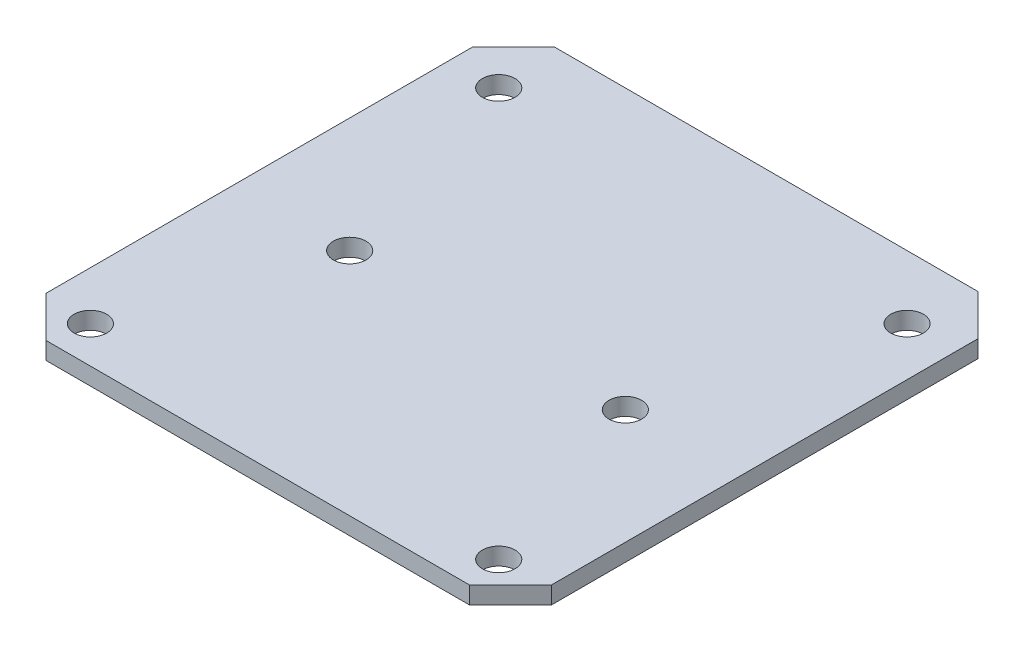
ISO-10303-21;
HEADER;
FILE_DESCRIPTION(('STEP AP214'),'2;1');
FILE_NAME('part.step','',(''),(''),'','','');
FILE_SCHEMA(('AUTOMOTIVE_DESIGN { 1 0 10303 214 1 1 1 1 }'));
ENDSEC;
DATA;
#1=APPLICATION_CONTEXT('core data for automotive mechanical design processes');
#2=APPLICATION_PROTOCOL_DEFINITION('international standard','automotive_design',2000,#1);
#3=PRODUCT_CONTEXT('',#1,'mechanical');
#4=PRODUCT('Part','Part','',(#3));
#5=PRODUCT_RELATED_PRODUCT_CATEGORY('part','',(#4));
#6=PRODUCT_DEFINITION_FORMATION('','',#4);
#7=PRODUCT_DEFINITION_CONTEXT('part definition',#1,'design');
#8=PRODUCT_DEFINITION('design','',#6,#7);
#9=PRODUCT_DEFINITION_SHAPE('','',#8);
#10=(LENGTH_UNIT() NAMED_UNIT(*) SI_UNIT(.MILLI.,.METRE.));
#11=(NAMED_UNIT(*) PLANE_ANGLE_UNIT() SI_UNIT($,.RADIAN.));
#12=(NAMED_UNIT(*) SI_UNIT($,.STERADIAN.) SOLID_ANGLE_UNIT());
#13=UNCERTAINTY_MEASURE_WITH_UNIT(LENGTH_MEASURE(1.E-05),#10,'distance_accuracy_value','');
#14=(GEOMETRIC_REPRESENTATION_CONTEXT(3) GLOBAL_UNCERTAINTY_ASSIGNED_CONTEXT((#13)) GLOBAL_UNIT_ASSIGNED_CONTEXT((#10,
#11,#12)) REPRESENTATION_CONTEXT('',''));
#15=CARTESIAN_POINT('',(0.,0.,0.));
#16=DIRECTION('',(0.,0.,1.));
#17=DIRECTION('',(1.,0.,0.));
#18=AXIS2_PLACEMENT_3D('',#15,#16,#17);
#19=CARTESIAN_POINT('',(24.75,1.7,-24.9));
#20=DIRECTION('',(-1.,0.,0.));
#21=DIRECTION('',(0.,0.,1.));
#22=AXIS2_PLACEMENT_3D('',#19,#20,#21);
#23=PLANE('',#22);
#24=DIRECTION('',(0.,0.,-1.));
#25=VECTOR('',#24,1.);
#26=CARTESIAN_POINT('',(24.75,1.7,-24.9));
#27=LINE('',#26,#25);
#28=CARTESIAN_POINT('',(24.75,1.7,20.9));
#29=VERTEX_POINT('',#28);
#30=CARTESIAN_POINT('',(24.75,1.7,-20.9));
#31=VERTEX_POINT('',#30);
#32=EDGE_CURVE('E124',#29,#31,#27,.T.);
#33=ORIENTED_EDGE('',*,*,#32,.F.);
#34=DIRECTION('',(0.,-1.,0.));
#35=VECTOR('',#34,1.);
#36=CARTESIAN_POINT('',(24.75,1.7,20.9));
#37=LINE('',#36,#35);
#38=CARTESIAN_POINT('',(24.75,0.,20.9));
#39=VERTEX_POINT('',#38);
#40=EDGE_CURVE('E150',#29,#39,#37,.T.);
#41=ORIENTED_EDGE('',*,*,#40,.T.);
#42=DIRECTION('',(0.,0.,-1.));
#43=VECTOR('',#42,1.);
#44=CARTESIAN_POINT('',(24.75,0.,-24.9));
#45=LINE('',#44,#43);
#46=CARTESIAN_POINT('',(24.75,0.,-20.9));
#47=VERTEX_POINT('',#46);
#48=EDGE_CURVE('E156',#39,#47,#45,.T.);
#49=ORIENTED_EDGE('',*,*,#48,.T.);
#50=DIRECTION('',(0.,1.,0.));
#51=VECTOR('',#50,1.);
#52=CARTESIAN_POINT('',(24.75,1.7,-20.9));
#53=LINE('',#52,#51);
#54=EDGE_CURVE('E148',#47,#31,#53,.T.);
#55=ORIENTED_EDGE('',*,*,#54,.T.);
#56=EDGE_LOOP('',(#33,#41,#49,#55));
#57=FACE_BOUND('',#56,.T.);
#58=ADVANCED_FACE('F32',(#57),#23,.F.);
#59=CARTESIAN_POINT('',(-24.75,1.7,-24.9));
#60=DIRECTION('',(0.,0.,1.));
#61=DIRECTION('',(1.,0.,0.));
#62=AXIS2_PLACEMENT_3D('',#59,#60,#61);
#63=PLANE('',#62);
#64=DIRECTION('',(-1.,0.,0.));
#65=VECTOR('',#64,1.);
#66=CARTESIAN_POINT('',(-24.75,1.7,-24.9));
#67=LINE('',#66,#65);
#68=CARTESIAN_POINT('',(20.75,1.7,-24.9));
#69=VERTEX_POINT('',#68);
#70=CARTESIAN_POINT('',(-20.75,1.7,-24.9));
#71=VERTEX_POINT('',#70);
#72=EDGE_CURVE('E127',#69,#71,#67,.T.);
#73=ORIENTED_EDGE('',*,*,#72,.F.);
#74=DIRECTION('',(0.,-1.,0.));
#75=VECTOR('',#74,1.);
#76=CARTESIAN_POINT('',(20.75,1.7,-24.9));
#77=LINE('',#76,#75);
#78=CARTESIAN_POINT('',(20.75,0.,-24.9));
#79=VERTEX_POINT('',#78);
#80=EDGE_CURVE('E11',#69,#79,#77,.T.);
#81=ORIENTED_EDGE('',*,*,#80,.T.);
#82=DIRECTION('',(-1.,0.,0.));
#83=VECTOR('',#82,1.);
#84=CARTESIAN_POINT('',(-24.75,0.,-24.9));
#85=LINE('',#84,#83);
#86=CARTESIAN_POINT('',(-20.75,0.,-24.9));
#87=VERTEX_POINT('',#86);
#88=EDGE_CURVE('E129',#79,#87,#85,.T.);
#89=ORIENTED_EDGE('',*,*,#88,.T.);
#90=DIRECTION('',(0.,1.,0.));
#91=VECTOR('',#90,1.);
#92=CARTESIAN_POINT('',(-20.75,1.7,-24.9));
#93=LINE('',#92,#91);
#94=EDGE_CURVE('E40',#87,#71,#93,.T.);
#95=ORIENTED_EDGE('',*,*,#94,.T.);
#96=EDGE_LOOP('',(#73,#81,#89,#95));
#97=FACE_BOUND('',#96,.T.);
#98=ADVANCED_FACE('F226',(#97),#63,.F.);
#99=CARTESIAN_POINT('',(-24.75,1.7,-24.9));
#100=DIRECTION('',(1.,0.,0.));
#101=DIRECTION('',(0.,0.,-1.));
#102=AXIS2_PLACEMENT_3D('',#99,#100,#101);
#103=PLANE('',#102);
#104=DIRECTION('',(0.,0.,1.));
#105=VECTOR('',#104,1.);
#106=CARTESIAN_POINT('',(-24.75,0.,-24.9));
#107=LINE('',#106,#105);
#108=CARTESIAN_POINT('',(-24.75,0.,-20.9));
#109=VERTEX_POINT('',#108);
#110=CARTESIAN_POINT('',(-24.75,0.,20.9));
#111=VERTEX_POINT('',#110);
#112=EDGE_CURVE('E125',#109,#111,#107,.T.);
#113=ORIENTED_EDGE('',*,*,#112,.T.);
#114=DIRECTION('',(0.,1.,0.));
#115=VECTOR('',#114,1.);
#116=CARTESIAN_POINT('',(-24.75,1.7,20.9));
#117=LINE('',#116,#115);
#118=CARTESIAN_POINT('',(-24.75,1.7,20.9));
#119=VERTEX_POINT('',#118);
#120=EDGE_CURVE('E103',#111,#119,#117,.T.);
#121=ORIENTED_EDGE('',*,*,#120,.T.);
#122=DIRECTION('',(0.,0.,1.));
#123=VECTOR('',#122,1.);
#124=CARTESIAN_POINT('',(-24.75,1.7,-24.9));
#125=LINE('',#124,#123);
#126=CARTESIAN_POINT('',(-24.75,1.7,-20.9));
#127=VERTEX_POINT('',#126);
#128=EDGE_CURVE('E168',#127,#119,#125,.T.);
#129=ORIENTED_EDGE('',*,*,#128,.F.);
#130=DIRECTION('',(0.,-1.,0.));
#131=VECTOR('',#130,1.);
#132=CARTESIAN_POINT('',(-24.75,1.7,-20.9));
#133=LINE('',#132,#131);
#134=EDGE_CURVE('E108',#127,#109,#133,.T.);
#135=ORIENTED_EDGE('',*,*,#134,.T.);
#136=EDGE_LOOP('',(#113,#121,#129,#135));
#137=FACE_BOUND('',#136,.T.);
#138=ADVANCED_FACE('F224',(#137),#103,.F.);
#139=CARTESIAN_POINT('',(-24.75,1.7,24.9));
#140=DIRECTION('',(0.,0.,-1.));
#141=DIRECTION('',(-1.,0.,0.));
#142=AXIS2_PLACEMENT_3D('',#139,#140,#141);
#143=PLANE('',#142);
#144=DIRECTION('',(1.,0.,0.));
#145=VECTOR('',#144,1.);
#146=CARTESIAN_POINT('',(-24.75,1.7,24.9));
#147=LINE('',#146,#145);
#148=CARTESIAN_POINT('',(-20.75,1.7,24.9));
#149=VERTEX_POINT('',#148);
#150=CARTESIAN_POINT('',(20.75,1.7,24.9));
#151=VERTEX_POINT('',#150);
#152=EDGE_CURVE('E118',#149,#151,#147,.T.);
#153=ORIENTED_EDGE('',*,*,#152,.F.);
#154=DIRECTION('',(0.,-1.,0.));
#155=VECTOR('',#154,1.);
#156=CARTESIAN_POINT('',(-20.75,1.7,24.9));
#157=LINE('',#156,#155);
#158=CARTESIAN_POINT('',(-20.75,0.,24.9));
#159=VERTEX_POINT('',#158);
#160=EDGE_CURVE('E102',#149,#159,#157,.T.);
#161=ORIENTED_EDGE('',*,*,#160,.T.);
#162=DIRECTION('',(1.,0.,0.));
#163=VECTOR('',#162,1.);
#164=CARTESIAN_POINT('',(-24.75,0.,24.9));
#165=LINE('',#164,#163);
#166=CARTESIAN_POINT('',(20.75,0.,24.9));
#167=VERTEX_POINT('',#166);
#168=EDGE_CURVE('E115',#159,#167,#165,.T.);
#169=ORIENTED_EDGE('',*,*,#168,.T.);
#170=DIRECTION('',(0.,1.,0.));
#171=VECTOR('',#170,1.);
#172=CARTESIAN_POINT('',(20.75,1.7,24.9));
#173=LINE('',#172,#171);
#174=EDGE_CURVE('E120',#167,#151,#173,.T.);
#175=ORIENTED_EDGE('',*,*,#174,.T.);
#176=EDGE_LOOP('',(#153,#161,#169,#175));
#177=FACE_BOUND('',#176,.T.);
#178=ADVANCED_FACE('F114',(#177),#143,.F.);
#179=CARTESIAN_POINT('',(0.,1.7,0.));
#180=DIRECTION('',(0.,1.,0.));
#181=DIRECTION('',(0.,0.,1.));
#182=AXIS2_PLACEMENT_3D('',#179,#180,#181);
#183=PLANE('',#182);
#184=CARTESIAN_POINT('',(-13.5,1.7,2.4));
#185=DIRECTION('',(0.,1.,0.));
#186=DIRECTION('',(0.,0.,1.));
#187=AXIS2_PLACEMENT_3D('',#184,#185,#186);
#188=CIRCLE('',#187,1.59999999999999);
#189=CARTESIAN_POINT('',(-13.5,1.7,3.99999999999999));
#190=VERTEX_POINT('',#189);
#191=EDGE_CURVE('E201',#190,#190,#188,.T.);
#192=ORIENTED_EDGE('',*,*,#191,.F.);
#193=EDGE_LOOP('',(#192));
#194=FACE_BOUND('',#193,.T.);
#195=CARTESIAN_POINT('',(13.5,1.7,2.4));
#196=DIRECTION('',(0.,1.,0.));
#197=DIRECTION('',(0.,0.,1.));
#198=AXIS2_PLACEMENT_3D('',#195,#196,#197);
#199=CIRCLE('',#198,1.59999999999999);
#200=CARTESIAN_POINT('',(13.5,1.7,3.99999999999999));
#201=VERTEX_POINT('',#200);
#202=EDGE_CURVE('E195',#201,#201,#199,.T.);
#203=ORIENTED_EDGE('',*,*,#202,.F.);
#204=EDGE_LOOP('',(#203));
#205=FACE_BOUND('',#204,.T.);
#206=CARTESIAN_POINT('',(-20.,1.7,21.3));
#207=DIRECTION('',(0.,1.,0.));
#208=DIRECTION('',(0.,0.,1.));
#209=AXIS2_PLACEMENT_3D('',#206,#207,#208);
#210=CIRCLE('',#209,1.59999999999999);
#211=CARTESIAN_POINT('',(-20.,1.7,22.9));
#212=VERTEX_POINT('',#211);
#213=EDGE_CURVE('E186',#212,#212,#210,.T.);
#214=ORIENTED_EDGE('',*,*,#213,.F.);
#215=EDGE_LOOP('',(#214));
#216=FACE_BOUND('',#215,.T.);
#217=CARTESIAN_POINT('',(20.,1.7,21.3));
#218=DIRECTION('',(0.,1.,0.));
#219=DIRECTION('',(0.,0.,1.));
#220=AXIS2_PLACEMENT_3D('',#217,#218,#219);
#221=CIRCLE('',#220,1.59999999999999);
#222=CARTESIAN_POINT('',(20.,1.7,22.9));
#223=VERTEX_POINT('',#222);
#224=EDGE_CURVE('E183',#223,#223,#221,.T.);
#225=ORIENTED_EDGE('',*,*,#224,.F.);
#226=EDGE_LOOP('',(#225));
#227=FACE_BOUND('',#226,.T.);
#228=CARTESIAN_POINT('',(20.,1.7,-18.7));
#229=DIRECTION('',(0.,1.,0.));
#230=DIRECTION('',(0.,0.,1.));
#231=AXIS2_PLACEMENT_3D('',#228,#229,#230);
#232=CIRCLE('',#231,1.59999999999999);
#233=CARTESIAN_POINT('',(20.,1.7,-17.1));
#234=VERTEX_POINT('',#233);
#235=EDGE_CURVE('E177',#234,#234,#232,.T.);
#236=ORIENTED_EDGE('',*,*,#235,.F.);
#237=EDGE_LOOP('',(#236));
#238=FACE_BOUND('',#237,.T.);
#239=CARTESIAN_POINT('',(-20.,1.7,-18.7));
#240=DIRECTION('',(0.,1.,0.));
#241=DIRECTION('',(0.,0.,1.));
#242=AXIS2_PLACEMENT_3D('',#239,#240,#241);
#243=CIRCLE('',#242,1.59999999999999);
#244=CARTESIAN_POINT('',(-20.,1.7,-17.1));
#245=VERTEX_POINT('',#244);
#246=EDGE_CURVE('E164',#245,#245,#243,.T.);
#247=ORIENTED_EDGE('',*,*,#246,.F.);
#248=EDGE_LOOP('',(#247));
#249=FACE_BOUND('',#248,.T.);
#250=ORIENTED_EDGE('',*,*,#128,.T.);
#251=DIRECTION('',(-0.707106781186546,0.,-0.707106781186549));
#252=VECTOR('',#251,1.);
#253=CARTESIAN_POINT('',(-22.825,1.7,22.8249999999999));
#254=LINE('',#253,#252);
#255=EDGE_CURVE('E146',#119,#149,#254,.F.);
#256=ORIENTED_EDGE('',*,*,#255,.T.);
#257=ORIENTED_EDGE('',*,*,#152,.T.);
#258=DIRECTION('',(-0.707106781186549,0.,0.707106781186546));
#259=VECTOR('',#258,1.);
#260=CARTESIAN_POINT('',(22.8249999999999,1.7,22.825));
#261=LINE('',#260,#259);
#262=EDGE_CURVE('E144',#151,#29,#261,.F.);
#263=ORIENTED_EDGE('',*,*,#262,.T.);
#264=ORIENTED_EDGE('',*,*,#32,.T.);
#265=DIRECTION('',(0.707106781186546,0.,0.707106781186549));
#266=VECTOR('',#265,1.);
#267=CARTESIAN_POINT('',(22.8250000000001,1.7,-22.8249999999999));
#268=LINE('',#267,#266);
#269=EDGE_CURVE('E53',#31,#69,#268,.F.);
#270=ORIENTED_EDGE('',*,*,#269,.T.);
#271=ORIENTED_EDGE('',*,*,#72,.T.);
#272=DIRECTION('',(0.707106781186549,0.,-0.707106781186546));
#273=VECTOR('',#272,1.);
#274=CARTESIAN_POINT('',(-22.8249999999999,1.7,-22.825));
#275=LINE('',#274,#273);
#276=EDGE_CURVE('E141',#71,#127,#275,.F.);
#277=ORIENTED_EDGE('',*,*,#276,.T.);
#278=EDGE_LOOP('',(#250,#256,#257,#263,#264,#270,#271,#277));
#279=FACE_BOUND('',#278,.T.);
#280=ADVANCED_FACE('F207',(#194,#205,#216,#227,#238,#249,#279),#183,.T.);
#281=CARTESIAN_POINT('',(0.,0.,0.));
#282=DIRECTION('',(0.,1.,0.));
#283=DIRECTION('',(0.,0.,1.));
#284=AXIS2_PLACEMENT_3D('',#281,#282,#283);
#285=PLANE('',#284);
#286=CARTESIAN_POINT('',(-13.5,0.,2.4));
#287=DIRECTION('',(0.,1.,0.));
#288=DIRECTION('',(0.,0.,1.));
#289=AXIS2_PLACEMENT_3D('',#286,#287,#288);
#290=CIRCLE('',#289,1.6);
#291=CARTESIAN_POINT('',(-13.5,0.,4.));
#292=VERTEX_POINT('',#291);
#293=EDGE_CURVE('E198',#292,#292,#290,.T.);
#294=ORIENTED_EDGE('',*,*,#293,.T.);
#295=EDGE_LOOP('',(#294));
#296=FACE_BOUND('',#295,.T.);
#297=CARTESIAN_POINT('',(13.5,0.,2.4));
#298=DIRECTION('',(0.,1.,0.));
#299=DIRECTION('',(0.,0.,1.));
#300=AXIS2_PLACEMENT_3D('',#297,#298,#299);
#301=CIRCLE('',#300,1.6);
#302=CARTESIAN_POINT('',(13.5,0.,4.));
#303=VERTEX_POINT('',#302);
#304=EDGE_CURVE('E192',#303,#303,#301,.T.);
#305=ORIENTED_EDGE('',*,*,#304,.T.);
#306=EDGE_LOOP('',(#305));
#307=FACE_BOUND('',#306,.T.);
#308=CARTESIAN_POINT('',(-20.,0.,21.3));
#309=DIRECTION('',(0.,1.,0.));
#310=DIRECTION('',(0.,0.,1.));
#311=AXIS2_PLACEMENT_3D('',#308,#309,#310);
#312=CIRCLE('',#311,1.6);
#313=CARTESIAN_POINT('',(-20.,0.,22.9));
#314=VERTEX_POINT('',#313);
#315=EDGE_CURVE('E189',#314,#314,#312,.T.);
#316=ORIENTED_EDGE('',*,*,#315,.T.);
#317=EDGE_LOOP('',(#316));
#318=FACE_BOUND('',#317,.T.);
#319=CARTESIAN_POINT('',(20.,0.,21.3));
#320=DIRECTION('',(0.,1.,0.));
#321=DIRECTION('',(0.,0.,1.));
#322=AXIS2_PLACEMENT_3D('',#319,#320,#321);
#323=CIRCLE('',#322,1.6);
#324=CARTESIAN_POINT('',(20.,0.,22.9));
#325=VERTEX_POINT('',#324);
#326=EDGE_CURVE('E180',#325,#325,#323,.T.);
#327=ORIENTED_EDGE('',*,*,#326,.T.);
#328=EDGE_LOOP('',(#327));
#329=FACE_BOUND('',#328,.T.);
#330=CARTESIAN_POINT('',(20.,0.,-18.7));
#331=DIRECTION('',(0.,1.,0.));
#332=DIRECTION('',(0.,0.,1.));
#333=AXIS2_PLACEMENT_3D('',#330,#331,#332);
#334=CIRCLE('',#333,1.6);
#335=CARTESIAN_POINT('',(20.,0.,-17.1));
#336=VERTEX_POINT('',#335);
#337=EDGE_CURVE('E174',#336,#336,#334,.T.);
#338=ORIENTED_EDGE('',*,*,#337,.T.);
#339=EDGE_LOOP('',(#338));
#340=FACE_BOUND('',#339,.T.);
#341=CARTESIAN_POINT('',(-20.,0.,-18.7));
#342=DIRECTION('',(0.,1.,0.));
#343=DIRECTION('',(0.,0.,1.));
#344=AXIS2_PLACEMENT_3D('',#341,#342,#343);
#345=CIRCLE('',#344,1.6);
#346=CARTESIAN_POINT('',(-20.,0.,-17.1));
#347=VERTEX_POINT('',#346);
#348=EDGE_CURVE('E161',#347,#347,#345,.T.);
#349=ORIENTED_EDGE('',*,*,#348,.T.);
#350=EDGE_LOOP('',(#349));
#351=FACE_BOUND('',#350,.T.);
#352=ORIENTED_EDGE('',*,*,#168,.F.);
#353=DIRECTION('',(0.707106781186546,0.,0.707106781186549));
#354=VECTOR('',#353,1.);
#355=CARTESIAN_POINT('',(-20.75,0.,24.9));
#356=LINE('',#355,#354);
#357=EDGE_CURVE('E98',#159,#111,#356,.F.);
#358=ORIENTED_EDGE('',*,*,#357,.T.);
#359=ORIENTED_EDGE('',*,*,#112,.F.);
#360=DIRECTION('',(-0.707106781186549,0.,0.707106781186546));
#361=VECTOR('',#360,1.);
#362=CARTESIAN_POINT('',(-24.75,0.,-20.9));
#363=LINE('',#362,#361);
#364=EDGE_CURVE('E119',#109,#87,#363,.F.);
#365=ORIENTED_EDGE('',*,*,#364,.T.);
#366=ORIENTED_EDGE('',*,*,#88,.F.);
#367=DIRECTION('',(-0.707106781186546,0.,-0.707106781186549));
#368=VECTOR('',#367,1.);
#369=CARTESIAN_POINT('',(20.75,0.,-24.9));
#370=LINE('',#369,#368);
#371=EDGE_CURVE('E135',#79,#47,#370,.F.);
#372=ORIENTED_EDGE('',*,*,#371,.T.);
#373=ORIENTED_EDGE('',*,*,#48,.F.);
#374=DIRECTION('',(0.707106781186549,0.,-0.707106781186546));
#375=VECTOR('',#374,1.);
#376=CARTESIAN_POINT('',(24.75,0.,20.9));
#377=LINE('',#376,#375);
#378=EDGE_CURVE('E109',#39,#167,#377,.F.);
#379=ORIENTED_EDGE('',*,*,#378,.T.);
#380=EDGE_LOOP('',(#352,#358,#359,#365,#366,#372,#373,#379));
#381=FACE_BOUND('',#380,.T.);
#382=ADVANCED_FACE('F122',(#296,#307,#318,#329,#340,#351,#381),#285,.F.);
#383=CARTESIAN_POINT('',(-20.,1.7,-18.7));
#384=DIRECTION('',(0.,1.,0.));
#385=DIRECTION('',(0.,0.,1.));
#386=AXIS2_PLACEMENT_3D('',#383,#384,#385);
#387=CYLINDRICAL_SURFACE('',#386,1.59999999999999);
#388=ORIENTED_EDGE('',*,*,#348,.F.);
#389=EDGE_LOOP('',(#388));
#390=FACE_BOUND('',#389,.T.);
#391=ORIENTED_EDGE('',*,*,#246,.T.);
#392=EDGE_LOOP('',(#391));
#393=FACE_BOUND('',#392,.T.);
#394=ADVANCED_FACE('F250',(#390,#393),#387,.F.);
#395=CARTESIAN_POINT('',(20.,1.7,-18.7));
#396=DIRECTION('',(0.,1.,0.));
#397=DIRECTION('',(0.,0.,1.));
#398=AXIS2_PLACEMENT_3D('',#395,#396,#397);
#399=CYLINDRICAL_SURFACE('',#398,1.59999999999999);
#400=ORIENTED_EDGE('',*,*,#337,.F.);
#401=EDGE_LOOP('',(#400));
#402=FACE_BOUND('',#401,.T.);
#403=ORIENTED_EDGE('',*,*,#235,.T.);
#404=EDGE_LOOP('',(#403));
#405=FACE_BOUND('',#404,.T.);
#406=ADVANCED_FACE('F255',(#402,#405),#399,.F.);
#407=CARTESIAN_POINT('',(20.,1.7,21.3));
#408=DIRECTION('',(0.,1.,0.));
#409=DIRECTION('',(0.,0.,1.));
#410=AXIS2_PLACEMENT_3D('',#407,#408,#409);
#411=CYLINDRICAL_SURFACE('',#410,1.59999999999999);
#412=ORIENTED_EDGE('',*,*,#326,.F.);
#413=EDGE_LOOP('',(#412));
#414=FACE_BOUND('',#413,.T.);
#415=ORIENTED_EDGE('',*,*,#224,.T.);
#416=EDGE_LOOP('',(#415));
#417=FACE_BOUND('',#416,.T.);
#418=ADVANCED_FACE('F259',(#414,#417),#411,.F.);
#419=CARTESIAN_POINT('',(-20.,1.7,21.3));
#420=DIRECTION('',(0.,1.,0.));
#421=DIRECTION('',(0.,0.,1.));
#422=AXIS2_PLACEMENT_3D('',#419,#420,#421);
#423=CYLINDRICAL_SURFACE('',#422,1.59999999999999);
#424=ORIENTED_EDGE('',*,*,#315,.F.);
#425=EDGE_LOOP('',(#424));
#426=FACE_BOUND('',#425,.T.);
#427=ORIENTED_EDGE('',*,*,#213,.T.);
#428=EDGE_LOOP('',(#427));
#429=FACE_BOUND('',#428,.T.);
#430=ADVANCED_FACE('F263',(#426,#429),#423,.F.);
#431=CARTESIAN_POINT('',(13.5,1.7,2.4));
#432=DIRECTION('',(0.,1.,0.));
#433=DIRECTION('',(0.,0.,1.));
#434=AXIS2_PLACEMENT_3D('',#431,#432,#433);
#435=CYLINDRICAL_SURFACE('',#434,1.59999999999999);
#436=ORIENTED_EDGE('',*,*,#304,.F.);
#437=EDGE_LOOP('',(#436));
#438=FACE_BOUND('',#437,.T.);
#439=ORIENTED_EDGE('',*,*,#202,.T.);
#440=EDGE_LOOP('',(#439));
#441=FACE_BOUND('',#440,.T.);
#442=ADVANCED_FACE('F267',(#438,#441),#435,.F.);
#443=CARTESIAN_POINT('',(-13.5,1.7,2.4));
#444=DIRECTION('',(0.,1.,0.));
#445=DIRECTION('',(0.,0.,1.));
#446=AXIS2_PLACEMENT_3D('',#443,#444,#445);
#447=CYLINDRICAL_SURFACE('',#446,1.59999999999999);
#448=ORIENTED_EDGE('',*,*,#293,.F.);
#449=EDGE_LOOP('',(#448));
#450=FACE_BOUND('',#449,.T.);
#451=ORIENTED_EDGE('',*,*,#191,.T.);
#452=EDGE_LOOP('',(#451));
#453=FACE_BOUND('',#452,.T.);
#454=ADVANCED_FACE('F205',(#450,#453),#447,.F.);
#455=CARTESIAN_POINT('',(-20.75,1.7,24.9));
#456=DIRECTION('',(0.707106781186549,0.,-0.707106781186546));
#457=DIRECTION('',(0.,-1.,0.));
#458=AXIS2_PLACEMENT_3D('',#455,#456,#457);
#459=PLANE('',#458);
#460=ORIENTED_EDGE('',*,*,#255,.F.);
#461=ORIENTED_EDGE('',*,*,#120,.F.);
#462=ORIENTED_EDGE('',*,*,#357,.F.);
#463=ORIENTED_EDGE('',*,*,#160,.F.);
#464=EDGE_LOOP('',(#460,#461,#462,#463));
#465=FACE_BOUND('',#464,.T.);
#466=ADVANCED_FACE('F101',(#465),#459,.F.);
#467=CARTESIAN_POINT('',(24.75,1.7,20.9));
#468=DIRECTION('',(-0.707106781186546,0.,-0.707106781186549));
#469=DIRECTION('',(0.,-1.,0.));
#470=AXIS2_PLACEMENT_3D('',#467,#468,#469);
#471=PLANE('',#470);
#472=ORIENTED_EDGE('',*,*,#262,.F.);
#473=ORIENTED_EDGE('',*,*,#174,.F.);
#474=ORIENTED_EDGE('',*,*,#378,.F.);
#475=ORIENTED_EDGE('',*,*,#40,.F.);
#476=EDGE_LOOP('',(#472,#473,#474,#475));
#477=FACE_BOUND('',#476,.T.);
#478=ADVANCED_FACE('F230',(#477),#471,.F.);
#479=CARTESIAN_POINT('',(20.75,1.7,-24.9));
#480=DIRECTION('',(-0.707106781186549,0.,0.707106781186546));
#481=DIRECTION('',(0.,-1.,0.));
#482=AXIS2_PLACEMENT_3D('',#479,#480,#481);
#483=PLANE('',#482);
#484=ORIENTED_EDGE('',*,*,#269,.F.);
#485=ORIENTED_EDGE('',*,*,#54,.F.);
#486=ORIENTED_EDGE('',*,*,#371,.F.);
#487=ORIENTED_EDGE('',*,*,#80,.F.);
#488=EDGE_LOOP('',(#484,#485,#486,#487));
#489=FACE_BOUND('',#488,.T.);
#490=ADVANCED_FACE('F229',(#489),#483,.F.);
#491=CARTESIAN_POINT('',(-24.75,1.7,-20.9));
#492=DIRECTION('',(0.707106781186546,0.,0.707106781186549));
#493=DIRECTION('',(0.,-1.,0.));
#494=AXIS2_PLACEMENT_3D('',#491,#492,#493);
#495=PLANE('',#494);
#496=ORIENTED_EDGE('',*,*,#276,.F.);
#497=ORIENTED_EDGE('',*,*,#94,.F.);
#498=ORIENTED_EDGE('',*,*,#364,.F.);
#499=ORIENTED_EDGE('',*,*,#134,.F.);
#500=EDGE_LOOP('',(#496,#497,#498,#499));
#501=FACE_BOUND('',#500,.T.);
#502=ADVANCED_FACE('F34',(#501),#495,.F.);
#503=CLOSED_SHELL('',(#58,#98,#138,#178,#280,#382,#394,#406,#418,#430,#442,#454,#466,#478,#490,#502));
#504=MANIFOLD_SOLID_BREP('B2',#503);
#505=ADVANCED_BREP_SHAPE_REPRESENTATION('',(#18,#504),#14);
#506=SHAPE_DEFINITION_REPRESENTATION(#9,#505);
ENDSEC;
END-ISO-10303-21;
